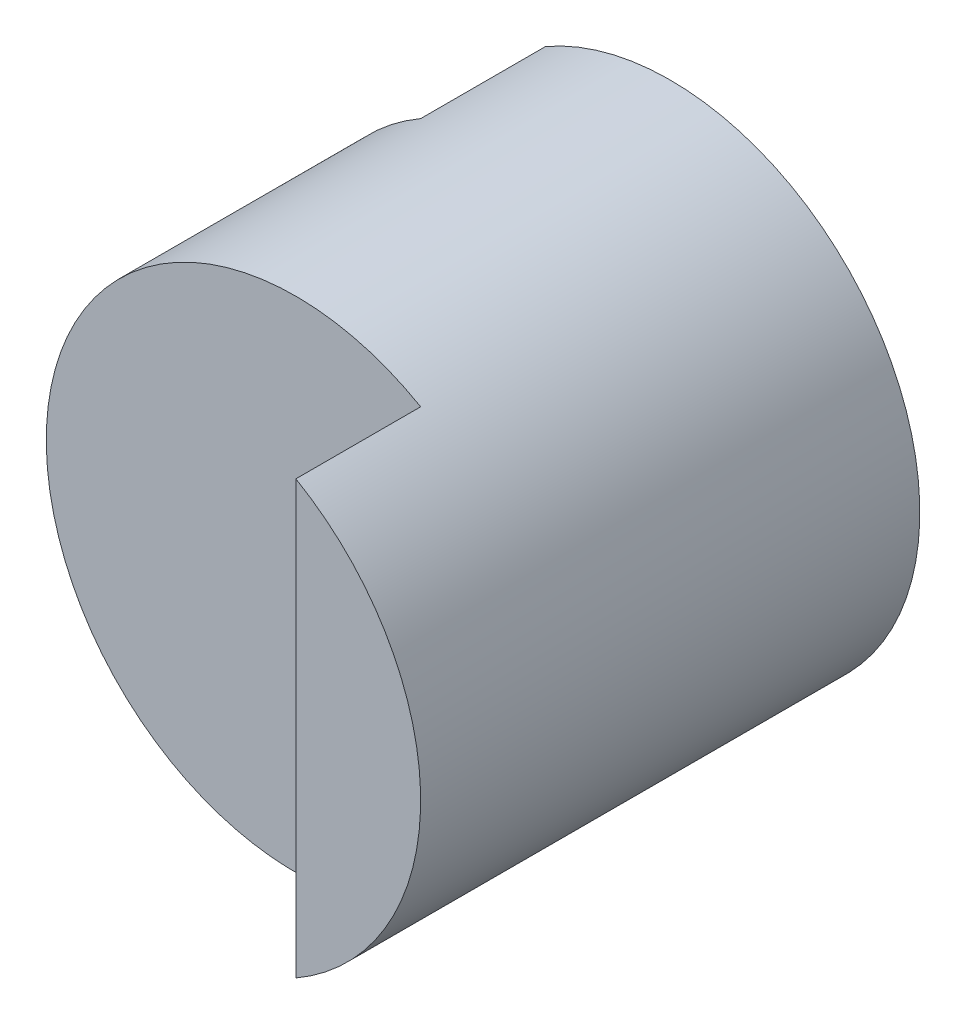
ISO-10303-21;
HEADER;
FILE_DESCRIPTION(('STEP AP214'),'2;1');
FILE_NAME('part.step','',(''),(''),'','','');
FILE_SCHEMA(('AUTOMOTIVE_DESIGN { 1 0 10303 214 1 1 1 1 }'));
ENDSEC;
DATA;
#1=APPLICATION_CONTEXT('core data for automotive mechanical design processes');
#2=APPLICATION_PROTOCOL_DEFINITION('international standard','automotive_design',2000,#1);
#3=PRODUCT_CONTEXT('',#1,'mechanical');
#4=PRODUCT('Part','Part','',(#3));
#5=PRODUCT_RELATED_PRODUCT_CATEGORY('part','',(#4));
#6=PRODUCT_DEFINITION_FORMATION('','',#4);
#7=PRODUCT_DEFINITION_CONTEXT('part definition',#1,'design');
#8=PRODUCT_DEFINITION('design','',#6,#7);
#9=PRODUCT_DEFINITION_SHAPE('','',#8);
#10=(LENGTH_UNIT() NAMED_UNIT(*) SI_UNIT(.MILLI.,.METRE.));
#11=(NAMED_UNIT(*) PLANE_ANGLE_UNIT() SI_UNIT($,.RADIAN.));
#12=(NAMED_UNIT(*) SI_UNIT($,.STERADIAN.) SOLID_ANGLE_UNIT());
#13=UNCERTAINTY_MEASURE_WITH_UNIT(LENGTH_MEASURE(1.E-05),#10,'distance_accuracy_value','');
#14=(GEOMETRIC_REPRESENTATION_CONTEXT(3) GLOBAL_UNCERTAINTY_ASSIGNED_CONTEXT((#13)) GLOBAL_UNIT_ASSIGNED_CONTEXT((#10,
#11,#12)) REPRESENTATION_CONTEXT('',''));
#15=CARTESIAN_POINT('',(0.,0.,0.));
#16=DIRECTION('',(0.,0.,1.));
#17=DIRECTION('',(1.,0.,0.));
#18=AXIS2_PLACEMENT_3D('',#15,#16,#17);
#19=CARTESIAN_POINT('',(0.,0.,40.));
#20=DIRECTION('',(0.,0.,-1.));
#21=DIRECTION('',(-1.,0.,0.));
#22=AXIS2_PLACEMENT_3D('',#19,#20,#21);
#23=CYLINDRICAL_SURFACE('',#22,20.);
#24=DIRECTION('',(0.,0.,-1.));
#25=VECTOR('',#24,1.);
#26=CARTESIAN_POINT('',(10.,17.3205080756888,40.));
#27=LINE('',#26,#25);
#28=CARTESIAN_POINT('',(10.,17.3205080756888,40.));
#29=VERTEX_POINT('',#28);
#30=CARTESIAN_POINT('',(10.,17.3205080756888,30.));
#31=VERTEX_POINT('',#30);
#32=EDGE_CURVE('E90',#29,#31,#27,.T.);
#33=ORIENTED_EDGE('',*,*,#32,.F.);
#34=CARTESIAN_POINT('',(0.,0.,40.));
#35=DIRECTION('',(0.,0.,1.));
#36=DIRECTION('',(1.,0.,0.));
#37=AXIS2_PLACEMENT_3D('',#34,#35,#36);
#38=CIRCLE('',#37,20.);
#39=CARTESIAN_POINT('',(10.,-17.3205080756888,40.));
#40=VERTEX_POINT('',#39);
#41=EDGE_CURVE('E93',#40,#29,#38,.T.);
#42=ORIENTED_EDGE('',*,*,#41,.F.);
#43=DIRECTION('',(0.,0.,-1.));
#44=VECTOR('',#43,1.);
#45=CARTESIAN_POINT('',(10.,-17.3205080756888,40.));
#46=LINE('',#45,#44);
#47=CARTESIAN_POINT('',(10.,-17.3205080756888,30.));
#48=VERTEX_POINT('',#47);
#49=EDGE_CURVE('E55',#48,#40,#46,.F.);
#50=ORIENTED_EDGE('',*,*,#49,.F.);
#51=CARTESIAN_POINT('',(0.,0.,30.));
#52=DIRECTION('',(0.,0.,1.));
#53=DIRECTION('',(1.,0.,0.));
#54=AXIS2_PLACEMENT_3D('',#51,#52,#53);
#55=CIRCLE('',#54,20.);
#56=EDGE_CURVE('E99',#31,#48,#55,.T.);
#57=ORIENTED_EDGE('',*,*,#56,.F.);
#58=EDGE_LOOP('',(#33,#42,#50,#57));
#59=FACE_BOUND('',#58,.T.);
#60=DIRECTION('',(0.,0.,-1.));
#61=VECTOR('',#60,1.);
#62=CARTESIAN_POINT('',(-9.99999999999999,17.3205080756888,40.));
#63=LINE('',#62,#61);
#64=CARTESIAN_POINT('',(-10.,17.3205080756888,10.));
#65=VERTEX_POINT('',#64);
#66=CARTESIAN_POINT('',(-10.,17.3205080756888,0.));
#67=VERTEX_POINT('',#66);
#68=EDGE_CURVE('E47',#65,#67,#63,.T.);
#69=ORIENTED_EDGE('',*,*,#68,.F.);
#70=CARTESIAN_POINT('',(0.,0.,10.));
#71=DIRECTION('',(0.,0.,-1.));
#72=DIRECTION('',(-1.,0.,0.));
#73=AXIS2_PLACEMENT_3D('',#70,#71,#72);
#74=CIRCLE('',#73,20.);
#75=CARTESIAN_POINT('',(-10.,-17.3205080756888,10.));
#76=VERTEX_POINT('',#75);
#77=EDGE_CURVE('E11',#76,#65,#74,.T.);
#78=ORIENTED_EDGE('',*,*,#77,.F.);
#79=DIRECTION('',(0.,0.,-1.));
#80=VECTOR('',#79,1.);
#81=CARTESIAN_POINT('',(-9.99999999999999,-17.3205080756888,40.));
#82=LINE('',#81,#80);
#83=CARTESIAN_POINT('',(-10.,-17.3205080756888,0.));
#84=VERTEX_POINT('',#83);
#85=EDGE_CURVE('E79',#84,#76,#82,.F.);
#86=ORIENTED_EDGE('',*,*,#85,.F.);
#87=CARTESIAN_POINT('',(0.,0.,0.));
#88=DIRECTION('',(0.,0.,1.));
#89=DIRECTION('',(1.,0.,0.));
#90=AXIS2_PLACEMENT_3D('',#87,#88,#89);
#91=CIRCLE('',#90,20.);
#92=EDGE_CURVE('E83',#84,#67,#91,.T.);
#93=ORIENTED_EDGE('',*,*,#92,.T.);
#94=EDGE_LOOP('',(#69,#78,#86,#93));
#95=FACE_BOUND('',#94,.T.);
#96=ADVANCED_FACE('F33',(#59,#95),#23,.T.);
#97=CARTESIAN_POINT('',(0.,0.,0.));
#98=DIRECTION('',(0.,0.,1.));
#99=DIRECTION('',(1.,0.,0.));
#100=AXIS2_PLACEMENT_3D('',#97,#98,#99);
#101=PLANE('',#100);
#102=DIRECTION('',(0.,-1.,0.));
#103=VECTOR('',#102,1.);
#104=CARTESIAN_POINT('',(-10.,0.,0.));
#105=LINE('',#104,#103);
#106=EDGE_CURVE('E40',#67,#84,#105,.T.);
#107=ORIENTED_EDGE('',*,*,#106,.F.);
#108=ORIENTED_EDGE('',*,*,#92,.F.);
#109=EDGE_LOOP('',(#107,#108));
#110=FACE_BOUND('',#109,.T.);
#111=ADVANCED_FACE('F101',(#110),#101,.F.);
#112=CARTESIAN_POINT('',(0.,0.,40.));
#113=DIRECTION('',(0.,0.,1.));
#114=DIRECTION('',(1.,0.,0.));
#115=AXIS2_PLACEMENT_3D('',#112,#113,#114);
#116=PLANE('',#115);
#117=ORIENTED_EDGE('',*,*,#41,.T.);
#118=DIRECTION('',(0.,-1.,0.));
#119=VECTOR('',#118,1.);
#120=CARTESIAN_POINT('',(10.,0.,40.));
#121=LINE('',#120,#119);
#122=EDGE_CURVE('E96',#29,#40,#121,.T.);
#123=ORIENTED_EDGE('',*,*,#122,.T.);
#124=EDGE_LOOP('',(#117,#123));
#125=FACE_BOUND('',#124,.T.);
#126=ADVANCED_FACE('F103',(#125),#116,.T.);
#127=CARTESIAN_POINT('',(-20.,40.,30.));
#128=DIRECTION('',(0.,0.,1.));
#129=DIRECTION('',(1.,0.,0.));
#130=AXIS2_PLACEMENT_3D('',#127,#128,#129);
#131=PLANE('',#130);
#132=DIRECTION('',(0.,-1.,0.));
#133=VECTOR('',#132,1.);
#134=CARTESIAN_POINT('',(10.,40.,30.));
#135=LINE('',#134,#133);
#136=EDGE_CURVE('E84',#31,#48,#135,.T.);
#137=ORIENTED_EDGE('',*,*,#136,.F.);
#138=ORIENTED_EDGE('',*,*,#56,.T.);
#139=EDGE_LOOP('',(#137,#138));
#140=FACE_BOUND('',#139,.T.);
#141=ADVANCED_FACE('F108',(#140),#131,.T.);
#142=CARTESIAN_POINT('',(10.,40.,40.));
#143=DIRECTION('',(-1.,0.,0.));
#144=DIRECTION('',(0.,0.,1.));
#145=AXIS2_PLACEMENT_3D('',#142,#143,#144);
#146=PLANE('',#145);
#147=ORIENTED_EDGE('',*,*,#32,.T.);
#148=ORIENTED_EDGE('',*,*,#136,.T.);
#149=ORIENTED_EDGE('',*,*,#49,.T.);
#150=ORIENTED_EDGE('',*,*,#122,.F.);
#151=EDGE_LOOP('',(#147,#148,#149,#150));
#152=FACE_BOUND('',#151,.T.);
#153=ADVANCED_FACE('F113',(#152),#146,.T.);
#154=CARTESIAN_POINT('',(-20.,40.,10.));
#155=DIRECTION('',(0.,0.,-1.));
#156=DIRECTION('',(-1.,0.,0.));
#157=AXIS2_PLACEMENT_3D('',#154,#155,#156);
#158=PLANE('',#157);
#159=ORIENTED_EDGE('',*,*,#77,.T.);
#160=DIRECTION('',(0.,-1.,0.));
#161=VECTOR('',#160,1.);
#162=CARTESIAN_POINT('',(-10.,40.,10.));
#163=LINE('',#162,#161);
#164=EDGE_CURVE('E75',#65,#76,#163,.T.);
#165=ORIENTED_EDGE('',*,*,#164,.T.);
#166=EDGE_LOOP('',(#159,#165));
#167=FACE_BOUND('',#166,.T.);
#168=ADVANCED_FACE('F74',(#167),#158,.T.);
#169=CARTESIAN_POINT('',(-10.,40.,0.));
#170=DIRECTION('',(-1.,0.,0.));
#171=DIRECTION('',(0.,0.,1.));
#172=AXIS2_PLACEMENT_3D('',#169,#170,#171);
#173=PLANE('',#172);
#174=ORIENTED_EDGE('',*,*,#68,.T.);
#175=ORIENTED_EDGE('',*,*,#106,.T.);
#176=ORIENTED_EDGE('',*,*,#85,.T.);
#177=ORIENTED_EDGE('',*,*,#164,.F.);
#178=EDGE_LOOP('',(#174,#175,#176,#177));
#179=FACE_BOUND('',#178,.T.);
#180=ADVANCED_FACE('F78',(#179),#173,.T.);
#181=CLOSED_SHELL('',(#96,#111,#126,#141,#153,#168,#180));
#182=MANIFOLD_SOLID_BREP('B2',#181);
#183=ADVANCED_BREP_SHAPE_REPRESENTATION('',(#18,#182),#14);
#184=SHAPE_DEFINITION_REPRESENTATION(#9,#183);
ENDSEC;
END-ISO-10303-21;
